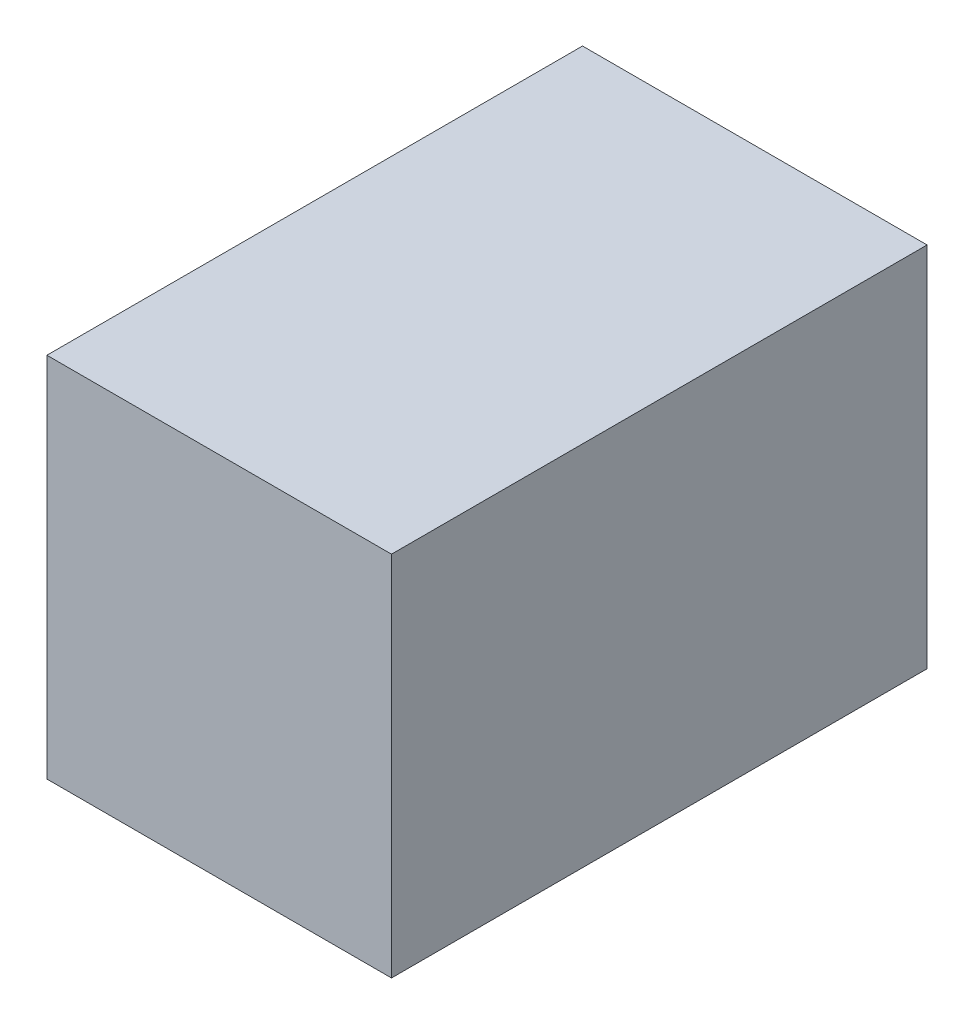
ISO-10303-21;
HEADER;
FILE_DESCRIPTION(('STEP AP214'),'2;1');
FILE_NAME('part.step','',(''),(''),'','','');
FILE_SCHEMA(('AUTOMOTIVE_DESIGN { 1 0 10303 214 1 1 1 1 }'));
ENDSEC;
DATA;
#1=APPLICATION_CONTEXT('core data for automotive mechanical design processes');
#2=APPLICATION_PROTOCOL_DEFINITION('international standard','automotive_design',2000,#1);
#3=PRODUCT_CONTEXT('',#1,'mechanical');
#4=PRODUCT('Part','Part','',(#3));
#5=PRODUCT_RELATED_PRODUCT_CATEGORY('part','',(#4));
#6=PRODUCT_DEFINITION_FORMATION('','',#4);
#7=PRODUCT_DEFINITION_CONTEXT('part definition',#1,'design');
#8=PRODUCT_DEFINITION('design','',#6,#7);
#9=PRODUCT_DEFINITION_SHAPE('','',#8);
#10=(LENGTH_UNIT() NAMED_UNIT(*) SI_UNIT(.MILLI.,.METRE.));
#11=(NAMED_UNIT(*) PLANE_ANGLE_UNIT() SI_UNIT($,.RADIAN.));
#12=(NAMED_UNIT(*) SI_UNIT($,.STERADIAN.) SOLID_ANGLE_UNIT());
#13=UNCERTAINTY_MEASURE_WITH_UNIT(LENGTH_MEASURE(1.E-05),#10,'distance_accuracy_value','');
#14=(GEOMETRIC_REPRESENTATION_CONTEXT(3) GLOBAL_UNCERTAINTY_ASSIGNED_CONTEXT((#13)) GLOBAL_UNIT_ASSIGNED_CONTEXT((#10,
#11,#12)) REPRESENTATION_CONTEXT('',''));
#15=CARTESIAN_POINT('',(0.,0.,0.));
#16=DIRECTION('',(0.,0.,1.));
#17=DIRECTION('',(1.,0.,0.));
#18=AXIS2_PLACEMENT_3D('',#15,#16,#17);
#19=CARTESIAN_POINT('',(21.,10.25,-17.875));
#20=DIRECTION('',(0.,0.,1.));
#21=DIRECTION('',(0.,-1.,0.));
#22=AXIS2_PLACEMENT_3D('',#19,#20,#21);
#23=PLANE('',#22);
#24=DIRECTION('',(0.,-1.,0.));
#25=VECTOR('',#24,1.);
#26=CARTESIAN_POINT('',(12.,10.25,-17.875));
#27=LINE('',#26,#25);
#28=CARTESIAN_POINT('',(12.,10.25,-17.875));
#29=VERTEX_POINT('',#28);
#30=CARTESIAN_POINT('',(12.,-10.25,-17.875));
#31=VERTEX_POINT('',#30);
#32=EDGE_CURVE('E202',#29,#31,#27,.T.);
#33=ORIENTED_EDGE('',*,*,#32,.F.);
#34=DIRECTION('',(1.,0.,0.));
#35=VECTOR('',#34,1.);
#36=CARTESIAN_POINT('',(0.,10.25,-17.875));
#37=LINE('',#36,#35);
#38=CARTESIAN_POINT('',(0.,10.25,-17.875));
#39=VERTEX_POINT('',#38);
#40=EDGE_CURVE('E206',#39,#29,#37,.T.);
#41=ORIENTED_EDGE('',*,*,#40,.F.);
#42=DIRECTION('',(0.,1.,0.));
#43=VECTOR('',#42,1.);
#44=CARTESIAN_POINT('',(0.,10.25,-17.875));
#45=LINE('',#44,#43);
#46=CARTESIAN_POINT('',(0.,12.25,-17.875));
#47=VERTEX_POINT('',#46);
#48=EDGE_CURVE('E92',#39,#47,#45,.T.);
#49=ORIENTED_EDGE('',*,*,#48,.T.);
#50=DIRECTION('',(-1.,0.,0.));
#51=VECTOR('',#50,1.);
#52=CARTESIAN_POINT('',(21.,12.25,-17.875));
#53=LINE('',#52,#51);
#54=CARTESIAN_POINT('',(23.,12.25,-17.875));
#55=VERTEX_POINT('',#54);
#56=EDGE_CURVE('E11',#55,#47,#53,.T.);
#57=ORIENTED_EDGE('',*,*,#56,.F.);
#58=DIRECTION('',(0.,1.,0.));
#59=VECTOR('',#58,1.);
#60=CARTESIAN_POINT('',(23.,10.25,-17.875));
#61=LINE('',#60,#59);
#62=CARTESIAN_POINT('',(23.,-12.25,-17.875));
#63=VERTEX_POINT('',#62);
#64=EDGE_CURVE('E120',#63,#55,#61,.T.);
#65=ORIENTED_EDGE('',*,*,#64,.F.);
#66=DIRECTION('',(-1.,0.,0.));
#67=VECTOR('',#66,1.);
#68=CARTESIAN_POINT('',(21.,-12.25,-17.875));
#69=LINE('',#68,#67);
#70=CARTESIAN_POINT('',(0.,-12.25,-17.875));
#71=VERTEX_POINT('',#70);
#72=EDGE_CURVE('E136',#63,#71,#69,.T.);
#73=ORIENTED_EDGE('',*,*,#72,.T.);
#74=CARTESIAN_POINT('',(0.,-10.25,-17.875));
#75=VERTEX_POINT('',#74);
#76=EDGE_CURVE('E140',#71,#75,#45,.T.);
#77=ORIENTED_EDGE('',*,*,#76,.T.);
#78=DIRECTION('',(-1.,0.,0.));
#79=VECTOR('',#78,1.);
#80=CARTESIAN_POINT('',(12.,-10.25,-17.875));
#81=LINE('',#80,#79);
#82=EDGE_CURVE('E198',#31,#75,#81,.T.);
#83=ORIENTED_EDGE('',*,*,#82,.F.);
#84=EDGE_LOOP('',(#33,#41,#49,#57,#65,#73,#77,#83));
#85=FACE_BOUND('',#84,.T.);
#86=ADVANCED_FACE('F43',(#85),#23,.F.);
#87=CARTESIAN_POINT('',(21.,12.25,15.875));
#88=DIRECTION('',(0.,-1.,0.));
#89=DIRECTION('',(0.,0.,-1.));
#90=AXIS2_PLACEMENT_3D('',#87,#88,#89);
#91=PLANE('',#90);
#92=DIRECTION('',(0.,0.,1.));
#93=VECTOR('',#92,1.);
#94=CARTESIAN_POINT('',(0.,12.25,15.875));
#95=LINE('',#94,#93);
#96=CARTESIAN_POINT('',(0.,12.25,17.875));
#97=VERTEX_POINT('',#96);
#98=EDGE_CURVE('E47',#47,#97,#95,.T.);
#99=ORIENTED_EDGE('',*,*,#98,.T.);
#100=DIRECTION('',(-1.,0.,0.));
#101=VECTOR('',#100,1.);
#102=CARTESIAN_POINT('',(21.,12.25,17.875));
#103=LINE('',#102,#101);
#104=CARTESIAN_POINT('',(23.,12.25,17.875));
#105=VERTEX_POINT('',#104);
#106=EDGE_CURVE('E53',#105,#97,#103,.T.);
#107=ORIENTED_EDGE('',*,*,#106,.F.);
#108=DIRECTION('',(0.,0.,1.));
#109=VECTOR('',#108,1.);
#110=CARTESIAN_POINT('',(23.,12.25,15.875));
#111=LINE('',#110,#109);
#112=EDGE_CURVE('E114',#55,#105,#111,.T.);
#113=ORIENTED_EDGE('',*,*,#112,.F.);
#114=ORIENTED_EDGE('',*,*,#56,.T.);
#115=EDGE_LOOP('',(#99,#107,#113,#114));
#116=FACE_BOUND('',#115,.T.);
#117=ADVANCED_FACE('F125',(#116),#91,.F.);
#118=CARTESIAN_POINT('',(21.,10.25,17.875));
#119=DIRECTION('',(0.,0.,-1.));
#120=DIRECTION('',(0.,1.,0.));
#121=AXIS2_PLACEMENT_3D('',#118,#119,#120);
#122=PLANE('',#121);
#123=DIRECTION('',(0.,-1.,0.));
#124=VECTOR('',#123,1.);
#125=CARTESIAN_POINT('',(0.,10.25,17.875));
#126=LINE('',#125,#124);
#127=CARTESIAN_POINT('',(0.,-12.25,17.875));
#128=VERTEX_POINT('',#127);
#129=EDGE_CURVE('E146',#97,#128,#126,.T.);
#130=ORIENTED_EDGE('',*,*,#129,.T.);
#131=DIRECTION('',(-1.,0.,0.));
#132=VECTOR('',#131,1.);
#133=CARTESIAN_POINT('',(21.,-12.25,17.875));
#134=LINE('',#133,#132);
#135=CARTESIAN_POINT('',(23.,-12.25,17.875));
#136=VERTEX_POINT('',#135);
#137=EDGE_CURVE('E129',#136,#128,#134,.T.);
#138=ORIENTED_EDGE('',*,*,#137,.F.);
#139=DIRECTION('',(0.,-1.,0.));
#140=VECTOR('',#139,1.);
#141=CARTESIAN_POINT('',(23.,10.25,17.875));
#142=LINE('',#141,#140);
#143=EDGE_CURVE('E117',#105,#136,#142,.T.);
#144=ORIENTED_EDGE('',*,*,#143,.F.);
#145=ORIENTED_EDGE('',*,*,#106,.T.);
#146=EDGE_LOOP('',(#130,#138,#144,#145));
#147=FACE_BOUND('',#146,.T.);
#148=ADVANCED_FACE('F131',(#147),#122,.F.);
#149=CARTESIAN_POINT('',(21.,-12.25,15.875));
#150=DIRECTION('',(0.,1.,0.));
#151=DIRECTION('',(0.,0.,1.));
#152=AXIS2_PLACEMENT_3D('',#149,#150,#151);
#153=PLANE('',#152);
#154=DIRECTION('',(0.,0.,-1.));
#155=VECTOR('',#154,1.);
#156=CARTESIAN_POINT('',(0.,-12.25,15.875));
#157=LINE('',#156,#155);
#158=EDGE_CURVE('E144',#128,#71,#157,.T.);
#159=ORIENTED_EDGE('',*,*,#158,.T.);
#160=ORIENTED_EDGE('',*,*,#72,.F.);
#161=DIRECTION('',(0.,0.,-1.));
#162=VECTOR('',#161,1.);
#163=CARTESIAN_POINT('',(23.,-12.25,15.875));
#164=LINE('',#163,#162);
#165=EDGE_CURVE('E70',#136,#63,#164,.T.);
#166=ORIENTED_EDGE('',*,*,#165,.F.);
#167=ORIENTED_EDGE('',*,*,#137,.T.);
#168=EDGE_LOOP('',(#159,#160,#166,#167));
#169=FACE_BOUND('',#168,.T.);
#170=ADVANCED_FACE('F224',(#169),#153,.F.);
#171=CARTESIAN_POINT('',(23.,0.,0.));
#172=DIRECTION('',(1.,0.,0.));
#173=DIRECTION('',(0.,0.,-1.));
#174=AXIS2_PLACEMENT_3D('',#171,#172,#173);
#175=PLANE('',#174);
#176=ORIENTED_EDGE('',*,*,#64,.T.);
#177=ORIENTED_EDGE('',*,*,#112,.T.);
#178=ORIENTED_EDGE('',*,*,#143,.T.);
#179=ORIENTED_EDGE('',*,*,#165,.T.);
#180=EDGE_LOOP('',(#176,#177,#178,#179));
#181=FACE_BOUND('',#180,.T.);
#182=ADVANCED_FACE('F45',(#181),#175,.T.);
#183=CARTESIAN_POINT('',(0.,0.,0.));
#184=DIRECTION('',(1.,0.,0.));
#185=DIRECTION('',(0.,0.,-1.));
#186=AXIS2_PLACEMENT_3D('',#183,#184,#185);
#187=PLANE('',#186);
#188=ORIENTED_EDGE('',*,*,#48,.F.);
#189=DIRECTION('',(0.,0.,1.));
#190=VECTOR('',#189,1.);
#191=CARTESIAN_POINT('',(0.,10.25,15.875));
#192=LINE('',#191,#190);
#193=CARTESIAN_POINT('',(0.,10.25,15.875));
#194=VERTEX_POINT('',#193);
#195=EDGE_CURVE('E182',#39,#194,#192,.T.);
#196=ORIENTED_EDGE('',*,*,#195,.T.);
#197=DIRECTION('',(0.,-1.,0.));
#198=VECTOR('',#197,1.);
#199=CARTESIAN_POINT('',(0.,10.25,15.875));
#200=LINE('',#199,#198);
#201=CARTESIAN_POINT('',(0.,-10.25,15.875));
#202=VERTEX_POINT('',#201);
#203=EDGE_CURVE('E61',#194,#202,#200,.T.);
#204=ORIENTED_EDGE('',*,*,#203,.T.);
#205=DIRECTION('',(0.,0.,-1.));
#206=VECTOR('',#205,1.);
#207=CARTESIAN_POINT('',(0.,-10.25,15.875));
#208=LINE('',#207,#206);
#209=EDGE_CURVE('E176',#202,#75,#208,.T.);
#210=ORIENTED_EDGE('',*,*,#209,.T.);
#211=ORIENTED_EDGE('',*,*,#76,.F.);
#212=ORIENTED_EDGE('',*,*,#158,.F.);
#213=ORIENTED_EDGE('',*,*,#129,.F.);
#214=ORIENTED_EDGE('',*,*,#98,.F.);
#215=EDGE_LOOP('',(#188,#196,#204,#210,#211,#212,#213,#214));
#216=FACE_BOUND('',#215,.T.);
#217=ADVANCED_FACE('F226',(#216),#187,.F.);
#218=CARTESIAN_POINT('',(21.,10.25,-15.875));
#219=DIRECTION('',(0.,0.,1.));
#220=DIRECTION('',(0.,-1.,0.));
#221=AXIS2_PLACEMENT_3D('',#218,#219,#220);
#222=PLANE('',#221);
#223=DIRECTION('',(0.,-1.,0.));
#224=VECTOR('',#223,1.);
#225=CARTESIAN_POINT('',(12.,10.25,-15.875));
#226=LINE('',#225,#224);
#227=CARTESIAN_POINT('',(12.,10.25,-15.875));
#228=VERTEX_POINT('',#227);
#229=CARTESIAN_POINT('',(12.,-10.25,-15.875));
#230=VERTEX_POINT('',#229);
#231=EDGE_CURVE('E190',#228,#230,#226,.T.);
#232=ORIENTED_EDGE('',*,*,#231,.T.);
#233=DIRECTION('',(-1.,0.,0.));
#234=VECTOR('',#233,1.);
#235=CARTESIAN_POINT('',(21.,-10.25,-15.875));
#236=LINE('',#235,#234);
#237=CARTESIAN_POINT('',(21.,-10.25,-15.875));
#238=VERTEX_POINT('',#237);
#239=EDGE_CURVE('E160',#238,#230,#236,.T.);
#240=ORIENTED_EDGE('',*,*,#239,.F.);
#241=DIRECTION('',(0.,1.,0.));
#242=VECTOR('',#241,1.);
#243=CARTESIAN_POINT('',(21.,10.25,-15.875));
#244=LINE('',#243,#242);
#245=CARTESIAN_POINT('',(21.,10.25,-15.875));
#246=VERTEX_POINT('',#245);
#247=EDGE_CURVE('E172',#238,#246,#244,.T.);
#248=ORIENTED_EDGE('',*,*,#247,.T.);
#249=DIRECTION('',(-1.,0.,0.));
#250=VECTOR('',#249,1.);
#251=CARTESIAN_POINT('',(21.,10.25,-15.875));
#252=LINE('',#251,#250);
#253=EDGE_CURVE('E151',#246,#228,#252,.T.);
#254=ORIENTED_EDGE('',*,*,#253,.T.);
#255=EDGE_LOOP('',(#232,#240,#248,#254));
#256=FACE_BOUND('',#255,.T.);
#257=ADVANCED_FACE('F250',(#256),#222,.T.);
#258=CARTESIAN_POINT('',(21.,10.25,15.875));
#259=DIRECTION('',(0.,-1.,0.));
#260=DIRECTION('',(0.,0.,-1.));
#261=AXIS2_PLACEMENT_3D('',#258,#259,#260);
#262=PLANE('',#261);
#263=ORIENTED_EDGE('',*,*,#195,.F.);
#264=ORIENTED_EDGE('',*,*,#40,.T.);
#265=DIRECTION('',(0.,0.,-1.));
#266=VECTOR('',#265,1.);
#267=CARTESIAN_POINT('',(12.,10.25,7.87894704043941));
#268=LINE('',#267,#266);
#269=EDGE_CURVE('E194',#228,#29,#268,.T.);
#270=ORIENTED_EDGE('',*,*,#269,.F.);
#271=ORIENTED_EDGE('',*,*,#253,.F.);
#272=DIRECTION('',(0.,0.,1.));
#273=VECTOR('',#272,1.);
#274=CARTESIAN_POINT('',(21.,10.25,15.875));
#275=LINE('',#274,#273);
#276=CARTESIAN_POINT('',(21.,10.25,15.875));
#277=VERTEX_POINT('',#276);
#278=EDGE_CURVE('E168',#246,#277,#275,.T.);
#279=ORIENTED_EDGE('',*,*,#278,.T.);
#280=DIRECTION('',(-1.,0.,0.));
#281=VECTOR('',#280,1.);
#282=CARTESIAN_POINT('',(21.,10.25,15.875));
#283=LINE('',#282,#281);
#284=EDGE_CURVE('E154',#277,#194,#283,.T.);
#285=ORIENTED_EDGE('',*,*,#284,.T.);
#286=EDGE_LOOP('',(#263,#264,#270,#271,#279,#285));
#287=FACE_BOUND('',#286,.T.);
#288=ADVANCED_FACE('F243',(#287),#262,.T.);
#289=CARTESIAN_POINT('',(21.,10.25,15.875));
#290=DIRECTION('',(0.,0.,-1.));
#291=DIRECTION('',(0.,1.,0.));
#292=AXIS2_PLACEMENT_3D('',#289,#290,#291);
#293=PLANE('',#292);
#294=ORIENTED_EDGE('',*,*,#203,.F.);
#295=ORIENTED_EDGE('',*,*,#284,.F.);
#296=DIRECTION('',(0.,-1.,0.));
#297=VECTOR('',#296,1.);
#298=CARTESIAN_POINT('',(21.,10.25,15.875));
#299=LINE('',#298,#297);
#300=CARTESIAN_POINT('',(21.,-10.25,15.875));
#301=VERTEX_POINT('',#300);
#302=EDGE_CURVE('E165',#277,#301,#299,.T.);
#303=ORIENTED_EDGE('',*,*,#302,.T.);
#304=DIRECTION('',(-1.,0.,0.));
#305=VECTOR('',#304,1.);
#306=CARTESIAN_POINT('',(21.,-10.25,15.875));
#307=LINE('',#306,#305);
#308=EDGE_CURVE('E157',#301,#202,#307,.T.);
#309=ORIENTED_EDGE('',*,*,#308,.T.);
#310=EDGE_LOOP('',(#294,#295,#303,#309));
#311=FACE_BOUND('',#310,.T.);
#312=ADVANCED_FACE('F247',(#311),#293,.T.);
#313=CARTESIAN_POINT('',(21.,-10.25,15.875));
#314=DIRECTION('',(0.,1.,0.));
#315=DIRECTION('',(0.,0.,1.));
#316=AXIS2_PLACEMENT_3D('',#313,#314,#315);
#317=PLANE('',#316);
#318=ORIENTED_EDGE('',*,*,#209,.F.);
#319=ORIENTED_EDGE('',*,*,#308,.F.);
#320=DIRECTION('',(0.,0.,-1.));
#321=VECTOR('',#320,1.);
#322=CARTESIAN_POINT('',(21.,-10.25,15.875));
#323=LINE('',#322,#321);
#324=EDGE_CURVE('E101',#301,#238,#323,.T.);
#325=ORIENTED_EDGE('',*,*,#324,.T.);
#326=ORIENTED_EDGE('',*,*,#239,.T.);
#327=DIRECTION('',(0.,0.,-1.));
#328=VECTOR('',#327,1.);
#329=CARTESIAN_POINT('',(12.,-10.25,7.87894704043941));
#330=LINE('',#329,#328);
#331=EDGE_CURVE('E186',#230,#31,#330,.T.);
#332=ORIENTED_EDGE('',*,*,#331,.T.);
#333=ORIENTED_EDGE('',*,*,#82,.T.);
#334=EDGE_LOOP('',(#318,#319,#325,#326,#332,#333));
#335=FACE_BOUND('',#334,.T.);
#336=ADVANCED_FACE('F252',(#335),#317,.T.);
#337=CARTESIAN_POINT('',(21.,0.,0.));
#338=DIRECTION('',(1.,0.,0.));
#339=DIRECTION('',(0.,0.,-1.));
#340=AXIS2_PLACEMENT_3D('',#337,#338,#339);
#341=PLANE('',#340);
#342=ORIENTED_EDGE('',*,*,#247,.F.);
#343=ORIENTED_EDGE('',*,*,#324,.F.);
#344=ORIENTED_EDGE('',*,*,#302,.F.);
#345=ORIENTED_EDGE('',*,*,#278,.F.);
#346=EDGE_LOOP('',(#342,#343,#344,#345));
#347=FACE_BOUND('',#346,.T.);
#348=ADVANCED_FACE('F248',(#347),#341,.F.);
#349=CARTESIAN_POINT('',(12.,10.25,7.87894704043941));
#350=DIRECTION('',(1.,0.,0.));
#351=DIRECTION('',(0.,1.,0.));
#352=AXIS2_PLACEMENT_3D('',#349,#350,#351);
#353=PLANE('',#352);
#354=ORIENTED_EDGE('',*,*,#269,.T.);
#355=ORIENTED_EDGE('',*,*,#32,.T.);
#356=ORIENTED_EDGE('',*,*,#331,.F.);
#357=ORIENTED_EDGE('',*,*,#231,.F.);
#358=EDGE_LOOP('',(#354,#355,#356,#357));
#359=FACE_BOUND('',#358,.T.);
#360=ADVANCED_FACE('F254',(#359),#353,.F.);
#361=CLOSED_SHELL('',(#86,#117,#148,#170,#182,#217,#257,#288,#312,#336,#348,#360));
#362=MANIFOLD_SOLID_BREP('B2',#361);
#363=ADVANCED_BREP_SHAPE_REPRESENTATION('',(#18,#362),#14);
#364=SHAPE_DEFINITION_REPRESENTATION(#9,#363);
ENDSEC;
END-ISO-10303-21;
